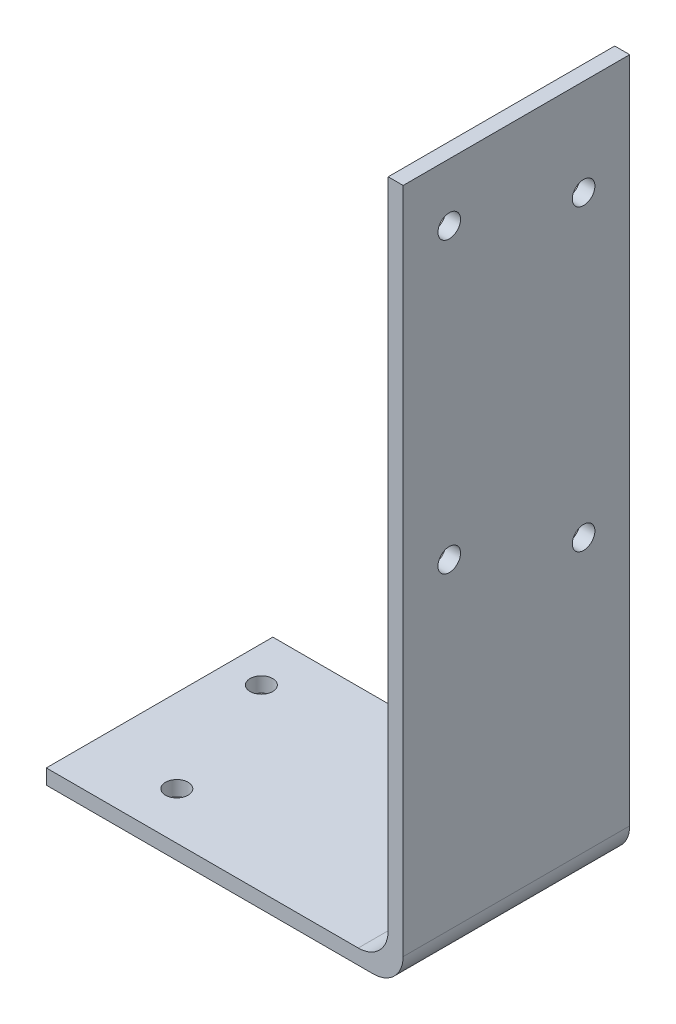
ISO-10303-21;
HEADER;
FILE_DESCRIPTION(('STEP AP214'),'2;1');
FILE_NAME('part.step','',(''),(''),'','','');
FILE_SCHEMA(('AUTOMOTIVE_DESIGN { 1 0 10303 214 1 1 1 1 }'));
ENDSEC;
DATA;
#1=APPLICATION_CONTEXT('core data for automotive mechanical design processes');
#2=APPLICATION_PROTOCOL_DEFINITION('international standard','automotive_design',2000,#1);
#3=PRODUCT_CONTEXT('',#1,'mechanical');
#4=PRODUCT('Part','Part','',(#3));
#5=PRODUCT_RELATED_PRODUCT_CATEGORY('part','',(#4));
#6=PRODUCT_DEFINITION_FORMATION('','',#4);
#7=PRODUCT_DEFINITION_CONTEXT('part definition',#1,'design');
#8=PRODUCT_DEFINITION('design','',#6,#7);
#9=PRODUCT_DEFINITION_SHAPE('','',#8);
#10=(LENGTH_UNIT() NAMED_UNIT(*) SI_UNIT(.MILLI.,.METRE.));
#11=(NAMED_UNIT(*) PLANE_ANGLE_UNIT() SI_UNIT($,.RADIAN.));
#12=(NAMED_UNIT(*) SI_UNIT($,.STERADIAN.) SOLID_ANGLE_UNIT());
#13=UNCERTAINTY_MEASURE_WITH_UNIT(LENGTH_MEASURE(1.E-05),#10,'distance_accuracy_value','');
#14=(GEOMETRIC_REPRESENTATION_CONTEXT(3) GLOBAL_UNCERTAINTY_ASSIGNED_CONTEXT((#13)) GLOBAL_UNIT_ASSIGNED_CONTEXT((#10,
#11,#12)) REPRESENTATION_CONTEXT('',''));
#15=CARTESIAN_POINT('',(0.,0.,0.));
#16=DIRECTION('',(0.,0.,1.));
#17=DIRECTION('',(1.,0.,0.));
#18=AXIS2_PLACEMENT_3D('',#15,#16,#17);
#19=CARTESIAN_POINT('',(0.,0.,38.4429));
#20=DIRECTION('',(0.,1.,0.));
#21=DIRECTION('',(0.,0.,1.));
#22=AXIS2_PLACEMENT_3D('',#19,#20,#21);
#23=PLANE('',#22);
#24=CARTESIAN_POINT('',(59.0042,0.,8.0137));
#25=DIRECTION('',(0.,1.,0.));
#26=DIRECTION('',(-1.,0.,0.));
#27=AXIS2_PLACEMENT_3D('',#24,#25,#26);
#28=CIRCLE('',#27,1.91769999999999);
#29=CARTESIAN_POINT('',(57.0865,0.,8.0137));
#30=VERTEX_POINT('',#29);
#31=EDGE_CURVE('E200',#30,#30,#28,.T.);
#32=ORIENTED_EDGE('',*,*,#31,.T.);
#33=EDGE_LOOP('',(#32));
#34=FACE_BOUND('',#33,.T.);
#35=CARTESIAN_POINT('',(67.0687,0.,30.4292));
#36=DIRECTION('',(0.,1.,0.));
#37=DIRECTION('',(-1.,0.,0.));
#38=AXIS2_PLACEMENT_3D('',#35,#36,#37);
#39=CIRCLE('',#38,1.91769999999999);
#40=CARTESIAN_POINT('',(65.151,0.,30.4292));
#41=VERTEX_POINT('',#40);
#42=EDGE_CURVE('E132',#41,#41,#39,.T.);
#43=ORIENTED_EDGE('',*,*,#42,.T.);
#44=EDGE_LOOP('',(#43));
#45=FACE_BOUND('',#44,.T.);
#46=DIRECTION('',(1.,0.,0.));
#47=VECTOR('',#46,1.);
#48=CARTESIAN_POINT('',(0.,0.,38.4429));
#49=LINE('',#48,#47);
#50=CARTESIAN_POINT('',(52.9336,0.,38.4429));
#51=VERTEX_POINT('',#50);
#52=CARTESIAN_POINT('',(108.4072,0.,38.4429));
#53=VERTEX_POINT('',#52);
#54=EDGE_CURVE('E56',#51,#53,#49,.T.);
#55=ORIENTED_EDGE('',*,*,#54,.F.);
#56=DIRECTION('',(0.,0.,-1.));
#57=VECTOR('',#56,1.);
#58=CARTESIAN_POINT('',(52.9336,0.,0.));
#59=LINE('',#58,#57);
#60=CARTESIAN_POINT('',(52.9336,0.,0.));
#61=VERTEX_POINT('',#60);
#62=EDGE_CURVE('E96',#51,#61,#59,.T.);
#63=ORIENTED_EDGE('',*,*,#62,.T.);
#64=DIRECTION('',(1.,0.,0.));
#65=VECTOR('',#64,1.);
#66=CARTESIAN_POINT('',(0.,0.,0.));
#67=LINE('',#66,#65);
#68=CARTESIAN_POINT('',(108.4072,0.,0.));
#69=VERTEX_POINT('',#68);
#70=EDGE_CURVE('E129',#61,#69,#67,.T.);
#71=ORIENTED_EDGE('',*,*,#70,.T.);
#72=DIRECTION('',(0.,0.,-1.));
#73=VECTOR('',#72,1.);
#74=CARTESIAN_POINT('',(108.4072,0.,38.4429));
#75=LINE('',#74,#73);
#76=EDGE_CURVE('E109',#69,#53,#75,.F.);
#77=ORIENTED_EDGE('',*,*,#76,.T.);
#78=EDGE_LOOP('',(#55,#63,#71,#77));
#79=FACE_BOUND('',#78,.T.);
#80=ADVANCED_FACE('F33',(#34,#45,#79),#23,.F.);
#81=CARTESIAN_POINT('',(113.4872,0.,38.4429));
#82=DIRECTION('',(-1.,0.,0.));
#83=DIRECTION('',(0.,0.,1.));
#84=AXIS2_PLACEMENT_3D('',#81,#82,#83);
#85=PLANE('',#84);
#86=CARTESIAN_POINT('',(113.4872,108.5723,30.6197));
#87=DIRECTION('',(-1.,0.,0.));
#88=DIRECTION('',(0.,-1.,0.));
#89=AXIS2_PLACEMENT_3D('',#86,#87,#88);
#90=CIRCLE('',#89,1.9177);
#91=CARTESIAN_POINT('',(113.4872,106.6546,30.6197));
#92=VERTEX_POINT('',#91);
#93=EDGE_CURVE('E176',#92,#92,#90,.T.);
#94=ORIENTED_EDGE('',*,*,#93,.T.);
#95=EDGE_LOOP('',(#94));
#96=FACE_BOUND('',#95,.T.);
#97=CARTESIAN_POINT('',(113.4872,102.0699,7.8232));
#98=DIRECTION('',(-1.,0.,0.));
#99=DIRECTION('',(0.,-1.,0.));
#100=AXIS2_PLACEMENT_3D('',#97,#98,#99);
#101=CIRCLE('',#100,1.9177);
#102=CARTESIAN_POINT('',(113.4872,100.1522,7.8232));
#103=VERTEX_POINT('',#102);
#104=EDGE_CURVE('E182',#103,#103,#101,.T.);
#105=ORIENTED_EDGE('',*,*,#104,.T.);
#106=EDGE_LOOP('',(#105));
#107=FACE_BOUND('',#106,.T.);
#108=CARTESIAN_POINT('',(113.4872,59.5249,30.6197));
#109=DIRECTION('',(-1.,0.,0.));
#110=DIRECTION('',(0.,-1.,0.));
#111=AXIS2_PLACEMENT_3D('',#108,#109,#110);
#112=CIRCLE('',#111,1.9177);
#113=CARTESIAN_POINT('',(113.4872,57.6072,30.6197));
#114=VERTEX_POINT('',#113);
#115=EDGE_CURVE('E188',#114,#114,#112,.T.);
#116=ORIENTED_EDGE('',*,*,#115,.T.);
#117=EDGE_LOOP('',(#116));
#118=FACE_BOUND('',#117,.T.);
#119=CARTESIAN_POINT('',(113.4872,51.3842,7.8232));
#120=DIRECTION('',(-1.,0.,0.));
#121=DIRECTION('',(0.,-1.,0.));
#122=AXIS2_PLACEMENT_3D('',#119,#120,#121);
#123=CIRCLE('',#122,1.9177);
#124=CARTESIAN_POINT('',(113.4872,49.4665,7.8232));
#125=VERTEX_POINT('',#124);
#126=EDGE_CURVE('E194',#125,#125,#123,.T.);
#127=ORIENTED_EDGE('',*,*,#126,.T.);
#128=EDGE_LOOP('',(#127));
#129=FACE_BOUND('',#128,.T.);
#130=DIRECTION('',(0.,1.,0.));
#131=VECTOR('',#130,1.);
#132=CARTESIAN_POINT('',(113.4872,0.,38.4429));
#133=LINE('',#132,#131);
#134=CARTESIAN_POINT('',(113.4872,5.08,38.4429));
#135=VERTEX_POINT('',#134);
#136=CARTESIAN_POINT('',(113.4872,118.4148,38.4429));
#137=VERTEX_POINT('',#136);
#138=EDGE_CURVE('E111',#135,#137,#133,.T.);
#139=ORIENTED_EDGE('',*,*,#138,.F.);
#140=DIRECTION('',(0.,0.,-1.));
#141=VECTOR('',#140,1.);
#142=CARTESIAN_POINT('',(113.4872,5.08,38.4429));
#143=LINE('',#142,#141);
#144=CARTESIAN_POINT('',(113.4872,5.08,0.));
#145=VERTEX_POINT('',#144);
#146=EDGE_CURVE('E148',#135,#145,#143,.T.);
#147=ORIENTED_EDGE('',*,*,#146,.T.);
#148=DIRECTION('',(0.,1.,0.));
#149=VECTOR('',#148,1.);
#150=CARTESIAN_POINT('',(113.4872,0.,0.));
#151=LINE('',#150,#149);
#152=CARTESIAN_POINT('',(113.4872,118.4148,0.));
#153=VERTEX_POINT('',#152);
#154=EDGE_CURVE('E131',#145,#153,#151,.T.);
#155=ORIENTED_EDGE('',*,*,#154,.T.);
#156=DIRECTION('',(0.,0.,-1.));
#157=VECTOR('',#156,1.);
#158=CARTESIAN_POINT('',(113.4872,118.4148,38.4429));
#159=LINE('',#158,#157);
#160=EDGE_CURVE('E140',#137,#153,#159,.T.);
#161=ORIENTED_EDGE('',*,*,#160,.F.);
#162=EDGE_LOOP('',(#139,#147,#155,#161));
#163=FACE_BOUND('',#162,.T.);
#164=ADVANCED_FACE('F226',(#96,#107,#118,#129,#163),#85,.F.);
#165=CARTESIAN_POINT('',(113.4872,118.4148,38.4429));
#166=DIRECTION('',(0.,-1.,0.));
#167=DIRECTION('',(0.,0.,-1.));
#168=AXIS2_PLACEMENT_3D('',#165,#166,#167);
#169=PLANE('',#168);
#170=DIRECTION('',(-1.,0.,0.));
#171=VECTOR('',#170,1.);
#172=CARTESIAN_POINT('',(113.4872,118.4148,0.));
#173=LINE('',#172,#171);
#174=CARTESIAN_POINT('',(110.9472,118.4148,0.));
#175=VERTEX_POINT('',#174);
#176=EDGE_CURVE('E134',#153,#175,#173,.T.);
#177=ORIENTED_EDGE('',*,*,#176,.T.);
#178=DIRECTION('',(0.,0.,-1.));
#179=VECTOR('',#178,1.);
#180=CARTESIAN_POINT('',(110.9472,118.4148,38.4429));
#181=LINE('',#180,#179);
#182=CARTESIAN_POINT('',(110.9472,118.4148,38.4429));
#183=VERTEX_POINT('',#182);
#184=EDGE_CURVE('E128',#183,#175,#181,.T.);
#185=ORIENTED_EDGE('',*,*,#184,.F.);
#186=DIRECTION('',(-1.,0.,0.));
#187=VECTOR('',#186,1.);
#188=CARTESIAN_POINT('',(113.4872,118.4148,38.4429));
#189=LINE('',#188,#187);
#190=EDGE_CURVE('E114',#137,#183,#189,.T.);
#191=ORIENTED_EDGE('',*,*,#190,.F.);
#192=ORIENTED_EDGE('',*,*,#160,.T.);
#193=EDGE_LOOP('',(#177,#185,#191,#192));
#194=FACE_BOUND('',#193,.T.);
#195=ADVANCED_FACE('F220',(#194),#169,.F.);
#196=CARTESIAN_POINT('',(110.9472,118.4148,38.4429));
#197=DIRECTION('',(1.,0.,0.));
#198=DIRECTION('',(0.,1.,0.));
#199=AXIS2_PLACEMENT_3D('',#196,#197,#198);
#200=PLANE('',#199);
#201=CARTESIAN_POINT('',(110.9472,108.5723,30.6197));
#202=DIRECTION('',(-1.,0.,0.));
#203=DIRECTION('',(0.,-1.,0.));
#204=AXIS2_PLACEMENT_3D('',#201,#202,#203);
#205=CIRCLE('',#204,1.9177);
#206=CARTESIAN_POINT('',(110.9472,106.6546,30.6197));
#207=VERTEX_POINT('',#206);
#208=EDGE_CURVE('E174',#207,#207,#205,.T.);
#209=ORIENTED_EDGE('',*,*,#208,.F.);
#210=EDGE_LOOP('',(#209));
#211=FACE_BOUND('',#210,.T.);
#212=CARTESIAN_POINT('',(110.9472,102.0699,7.8232));
#213=DIRECTION('',(-1.,0.,0.));
#214=DIRECTION('',(0.,-1.,0.));
#215=AXIS2_PLACEMENT_3D('',#212,#213,#214);
#216=CIRCLE('',#215,1.9177);
#217=CARTESIAN_POINT('',(110.9472,100.1522,7.8232));
#218=VERTEX_POINT('',#217);
#219=EDGE_CURVE('E179',#218,#218,#216,.T.);
#220=ORIENTED_EDGE('',*,*,#219,.F.);
#221=EDGE_LOOP('',(#220));
#222=FACE_BOUND('',#221,.T.);
#223=CARTESIAN_POINT('',(110.9472,59.5249,30.6197));
#224=DIRECTION('',(-1.,0.,0.));
#225=DIRECTION('',(0.,-1.,0.));
#226=AXIS2_PLACEMENT_3D('',#223,#224,#225);
#227=CIRCLE('',#226,1.9177);
#228=CARTESIAN_POINT('',(110.9472,57.6072,30.6197));
#229=VERTEX_POINT('',#228);
#230=EDGE_CURVE('E185',#229,#229,#227,.T.);
#231=ORIENTED_EDGE('',*,*,#230,.F.);
#232=EDGE_LOOP('',(#231));
#233=FACE_BOUND('',#232,.T.);
#234=CARTESIAN_POINT('',(110.9472,51.3842,7.8232));
#235=DIRECTION('',(-1.,0.,0.));
#236=DIRECTION('',(0.,-1.,0.));
#237=AXIS2_PLACEMENT_3D('',#234,#235,#236);
#238=CIRCLE('',#237,1.9177);
#239=CARTESIAN_POINT('',(110.9472,49.4665,7.8232));
#240=VERTEX_POINT('',#239);
#241=EDGE_CURVE('E191',#240,#240,#238,.T.);
#242=ORIENTED_EDGE('',*,*,#241,.F.);
#243=EDGE_LOOP('',(#242));
#244=FACE_BOUND('',#243,.T.);
#245=DIRECTION('',(0.,-1.,0.));
#246=VECTOR('',#245,1.);
#247=CARTESIAN_POINT('',(110.9472,118.4148,0.));
#248=LINE('',#247,#246);
#249=CARTESIAN_POINT('',(110.9472,7.62000000000002,0.));
#250=VERTEX_POINT('',#249);
#251=EDGE_CURVE('E117',#175,#250,#248,.T.);
#252=ORIENTED_EDGE('',*,*,#251,.T.);
#253=DIRECTION('',(0.,0.,-1.));
#254=VECTOR('',#253,1.);
#255=CARTESIAN_POINT('',(110.9472,7.62000000000001,38.4429));
#256=LINE('',#255,#254);
#257=CARTESIAN_POINT('',(110.9472,7.62000000000002,38.4429));
#258=VERTEX_POINT('',#257);
#259=EDGE_CURVE('E146',#250,#258,#256,.F.);
#260=ORIENTED_EDGE('',*,*,#259,.T.);
#261=DIRECTION('',(0.,-1.,0.));
#262=VECTOR('',#261,1.);
#263=CARTESIAN_POINT('',(110.9472,118.4148,38.4429));
#264=LINE('',#263,#262);
#265=EDGE_CURVE('E124',#183,#258,#264,.T.);
#266=ORIENTED_EDGE('',*,*,#265,.F.);
#267=ORIENTED_EDGE('',*,*,#184,.T.);
#268=EDGE_LOOP('',(#252,#260,#266,#267));
#269=FACE_BOUND('',#268,.T.);
#270=ADVANCED_FACE('F165',(#211,#222,#233,#244,#269),#200,.F.);
#271=CARTESIAN_POINT('',(110.9472,2.54000000000001,38.4429));
#272=DIRECTION('',(0.,-1.,0.));
#273=DIRECTION('',(1.,0.,0.));
#274=AXIS2_PLACEMENT_3D('',#271,#272,#273);
#275=PLANE('',#274);
#276=CARTESIAN_POINT('',(59.0042,2.54000000000001,8.0137));
#277=DIRECTION('',(0.,1.,0.));
#278=DIRECTION('',(-1.,0.,0.));
#279=AXIS2_PLACEMENT_3D('',#276,#277,#278);
#280=CIRCLE('',#279,1.91769999999999);
#281=CARTESIAN_POINT('',(57.0865,2.54000000000001,8.0137));
#282=VERTEX_POINT('',#281);
#283=EDGE_CURVE('E197',#282,#282,#280,.T.);
#284=ORIENTED_EDGE('',*,*,#283,.F.);
#285=EDGE_LOOP('',(#284));
#286=FACE_BOUND('',#285,.T.);
#287=CARTESIAN_POINT('',(67.0687,2.54000000000001,30.4292));
#288=DIRECTION('',(0.,1.,0.));
#289=DIRECTION('',(-1.,0.,0.));
#290=AXIS2_PLACEMENT_3D('',#287,#288,#289);
#291=CIRCLE('',#290,1.91769999999999);
#292=CARTESIAN_POINT('',(65.151,2.54000000000001,30.4292));
#293=VERTEX_POINT('',#292);
#294=EDGE_CURVE('E120',#293,#293,#291,.T.);
#295=ORIENTED_EDGE('',*,*,#294,.F.);
#296=EDGE_LOOP('',(#295));
#297=FACE_BOUND('',#296,.T.);
#298=DIRECTION('',(-1.,0.,0.));
#299=VECTOR('',#298,1.);
#300=CARTESIAN_POINT('',(110.9472,2.54000000000001,0.));
#301=LINE('',#300,#299);
#302=CARTESIAN_POINT('',(105.8672,2.54000000000001,0.));
#303=VERTEX_POINT('',#302);
#304=CARTESIAN_POINT('',(52.9336,2.54000000000001,0.));
#305=VERTEX_POINT('',#304);
#306=EDGE_CURVE('E112',#303,#305,#301,.T.);
#307=ORIENTED_EDGE('',*,*,#306,.T.);
#308=DIRECTION('',(0.,0.,-1.));
#309=VECTOR('',#308,1.);
#310=CARTESIAN_POINT('',(52.9336,2.54000000000001,0.));
#311=LINE('',#310,#309);
#312=CARTESIAN_POINT('',(52.9336,2.54000000000001,38.4429));
#313=VERTEX_POINT('',#312);
#314=EDGE_CURVE('E48',#313,#305,#311,.T.);
#315=ORIENTED_EDGE('',*,*,#314,.F.);
#316=DIRECTION('',(-1.,0.,0.));
#317=VECTOR('',#316,1.);
#318=CARTESIAN_POINT('',(110.9472,2.54000000000001,38.4429));
#319=LINE('',#318,#317);
#320=CARTESIAN_POINT('',(105.8672,2.54000000000001,38.4429));
#321=VERTEX_POINT('',#320);
#322=EDGE_CURVE('E106',#321,#313,#319,.T.);
#323=ORIENTED_EDGE('',*,*,#322,.F.);
#324=DIRECTION('',(0.,0.,-1.));
#325=VECTOR('',#324,1.);
#326=CARTESIAN_POINT('',(105.8672,2.54000000000001,0.));
#327=LINE('',#326,#325);
#328=EDGE_CURVE('E143',#321,#303,#327,.T.);
#329=ORIENTED_EDGE('',*,*,#328,.T.);
#330=EDGE_LOOP('',(#307,#315,#323,#329));
#331=FACE_BOUND('',#330,.T.);
#332=ADVANCED_FACE('F171',(#286,#297,#331),#275,.F.);
#333=CARTESIAN_POINT('',(0.,0.,38.4429));
#334=DIRECTION('',(0.,0.,1.));
#335=DIRECTION('',(1.,0.,0.));
#336=AXIS2_PLACEMENT_3D('',#333,#334,#335);
#337=PLANE('',#336);
#338=DIRECTION('',(0.,1.,0.));
#339=VECTOR('',#338,1.);
#340=CARTESIAN_POINT('',(52.9336,0.,38.4429));
#341=LINE('',#340,#339);
#342=EDGE_CURVE('E98',#51,#313,#341,.T.);
#343=ORIENTED_EDGE('',*,*,#342,.F.);
#344=ORIENTED_EDGE('',*,*,#54,.T.);
#345=CARTESIAN_POINT('',(108.4072,5.08,38.4429));
#346=DIRECTION('',(0.,0.,1.));
#347=DIRECTION('',(1.,0.,0.));
#348=AXIS2_PLACEMENT_3D('',#345,#346,#347);
#349=CIRCLE('',#348,5.08);
#350=EDGE_CURVE('E155',#53,#135,#349,.T.);
#351=ORIENTED_EDGE('',*,*,#350,.T.);
#352=ORIENTED_EDGE('',*,*,#138,.T.);
#353=ORIENTED_EDGE('',*,*,#190,.T.);
#354=ORIENTED_EDGE('',*,*,#265,.T.);
#355=CARTESIAN_POINT('',(105.8672,7.62000000000001,38.4429));
#356=DIRECTION('',(0.,0.,1.));
#357=DIRECTION('',(1.,0.,0.));
#358=AXIS2_PLACEMENT_3D('',#355,#356,#357);
#359=CIRCLE('',#358,5.08);
#360=EDGE_CURVE('E11',#258,#321,#359,.F.);
#361=ORIENTED_EDGE('',*,*,#360,.T.);
#362=ORIENTED_EDGE('',*,*,#322,.T.);
#363=EDGE_LOOP('',(#343,#344,#351,#352,#353,#354,#361,#362));
#364=FACE_BOUND('',#363,.T.);
#365=ADVANCED_FACE('F104',(#364),#337,.T.);
#366=CARTESIAN_POINT('',(0.,0.,0.));
#367=DIRECTION('',(0.,0.,1.));
#368=DIRECTION('',(1.,0.,0.));
#369=AXIS2_PLACEMENT_3D('',#366,#367,#368);
#370=PLANE('',#369);
#371=ORIENTED_EDGE('',*,*,#70,.F.);
#372=DIRECTION('',(0.,1.,0.));
#373=VECTOR('',#372,1.);
#374=CARTESIAN_POINT('',(52.9336,0.,0.));
#375=LINE('',#374,#373);
#376=EDGE_CURVE('E99',#61,#305,#375,.T.);
#377=ORIENTED_EDGE('',*,*,#376,.T.);
#378=ORIENTED_EDGE('',*,*,#306,.F.);
#379=CARTESIAN_POINT('',(105.8672,7.62000000000001,0.));
#380=DIRECTION('',(0.,0.,1.));
#381=DIRECTION('',(1.,0.,0.));
#382=AXIS2_PLACEMENT_3D('',#379,#380,#381);
#383=CIRCLE('',#382,5.08);
#384=EDGE_CURVE('E41',#303,#250,#383,.T.);
#385=ORIENTED_EDGE('',*,*,#384,.T.);
#386=ORIENTED_EDGE('',*,*,#251,.F.);
#387=ORIENTED_EDGE('',*,*,#176,.F.);
#388=ORIENTED_EDGE('',*,*,#154,.F.);
#389=CARTESIAN_POINT('',(108.4072,5.08,0.));
#390=DIRECTION('',(0.,0.,1.));
#391=DIRECTION('',(1.,0.,0.));
#392=AXIS2_PLACEMENT_3D('',#389,#390,#391);
#393=CIRCLE('',#392,5.08);
#394=EDGE_CURVE('E151',#145,#69,#393,.F.);
#395=ORIENTED_EDGE('',*,*,#394,.T.);
#396=EDGE_LOOP('',(#371,#377,#378,#385,#386,#387,#388,#395));
#397=FACE_BOUND('',#396,.T.);
#398=ADVANCED_FACE('F159',(#397),#370,.F.);
#399=CARTESIAN_POINT('',(67.0687,0.,30.4292));
#400=DIRECTION('',(0.,1.,0.));
#401=DIRECTION('',(-1.,0.,0.));
#402=AXIS2_PLACEMENT_3D('',#399,#400,#401);
#403=CYLINDRICAL_SURFACE('',#402,1.91769999999999);
#404=ORIENTED_EDGE('',*,*,#42,.F.);
#405=EDGE_LOOP('',(#404));
#406=FACE_BOUND('',#405,.T.);
#407=ORIENTED_EDGE('',*,*,#294,.T.);
#408=EDGE_LOOP('',(#407));
#409=FACE_BOUND('',#408,.T.);
#410=ADVANCED_FACE('F210',(#406,#409),#403,.F.);
#411=CARTESIAN_POINT('',(59.0042,0.,8.0137));
#412=DIRECTION('',(0.,1.,0.));
#413=DIRECTION('',(-1.,0.,0.));
#414=AXIS2_PLACEMENT_3D('',#411,#412,#413);
#415=CYLINDRICAL_SURFACE('',#414,1.91769999999999);
#416=ORIENTED_EDGE('',*,*,#31,.F.);
#417=EDGE_LOOP('',(#416));
#418=FACE_BOUND('',#417,.T.);
#419=ORIENTED_EDGE('',*,*,#283,.T.);
#420=EDGE_LOOP('',(#419));
#421=FACE_BOUND('',#420,.T.);
#422=ADVANCED_FACE('F261',(#418,#421),#415,.F.);
#423=CARTESIAN_POINT('',(113.4872,51.3842,7.8232));
#424=DIRECTION('',(-1.,0.,0.));
#425=DIRECTION('',(0.,-1.,0.));
#426=AXIS2_PLACEMENT_3D('',#423,#424,#425);
#427=CYLINDRICAL_SURFACE('',#426,1.9177);
#428=ORIENTED_EDGE('',*,*,#126,.F.);
#429=EDGE_LOOP('',(#428));
#430=FACE_BOUND('',#429,.T.);
#431=ORIENTED_EDGE('',*,*,#241,.T.);
#432=EDGE_LOOP('',(#431));
#433=FACE_BOUND('',#432,.T.);
#434=ADVANCED_FACE('F257',(#430,#433),#427,.F.);
#435=CARTESIAN_POINT('',(113.4872,59.5249,30.6197));
#436=DIRECTION('',(-1.,0.,0.));
#437=DIRECTION('',(0.,-1.,0.));
#438=AXIS2_PLACEMENT_3D('',#435,#436,#437);
#439=CYLINDRICAL_SURFACE('',#438,1.9177);
#440=ORIENTED_EDGE('',*,*,#115,.F.);
#441=EDGE_LOOP('',(#440));
#442=FACE_BOUND('',#441,.T.);
#443=ORIENTED_EDGE('',*,*,#230,.T.);
#444=EDGE_LOOP('',(#443));
#445=FACE_BOUND('',#444,.T.);
#446=ADVANCED_FACE('F248',(#442,#445),#439,.F.);
#447=CARTESIAN_POINT('',(113.4872,102.0699,7.8232));
#448=DIRECTION('',(-1.,0.,0.));
#449=DIRECTION('',(0.,-1.,0.));
#450=AXIS2_PLACEMENT_3D('',#447,#448,#449);
#451=CYLINDRICAL_SURFACE('',#450,1.9177);
#452=ORIENTED_EDGE('',*,*,#104,.F.);
#453=EDGE_LOOP('',(#452));
#454=FACE_BOUND('',#453,.T.);
#455=ORIENTED_EDGE('',*,*,#219,.T.);
#456=EDGE_LOOP('',(#455));
#457=FACE_BOUND('',#456,.T.);
#458=ADVANCED_FACE('F242',(#454,#457),#451,.F.);
#459=CARTESIAN_POINT('',(113.4872,108.5723,30.6197));
#460=DIRECTION('',(-1.,0.,0.));
#461=DIRECTION('',(0.,-1.,0.));
#462=AXIS2_PLACEMENT_3D('',#459,#460,#461);
#463=CYLINDRICAL_SURFACE('',#462,1.9177);
#464=ORIENTED_EDGE('',*,*,#93,.F.);
#465=EDGE_LOOP('',(#464));
#466=FACE_BOUND('',#465,.T.);
#467=ORIENTED_EDGE('',*,*,#208,.T.);
#468=EDGE_LOOP('',(#467));
#469=FACE_BOUND('',#468,.T.);
#470=ADVANCED_FACE('F236',(#466,#469),#463,.F.);
#471=CARTESIAN_POINT('',(105.8672,7.62000000000001,38.4429));
#472=DIRECTION('',(0.,0.,1.));
#473=DIRECTION('',(1.,0.,0.));
#474=AXIS2_PLACEMENT_3D('',#471,#472,#473);
#475=CYLINDRICAL_SURFACE('',#474,5.08);
#476=ORIENTED_EDGE('',*,*,#360,.F.);
#477=ORIENTED_EDGE('',*,*,#259,.F.);
#478=ORIENTED_EDGE('',*,*,#384,.F.);
#479=ORIENTED_EDGE('',*,*,#328,.F.);
#480=EDGE_LOOP('',(#476,#477,#478,#479));
#481=FACE_BOUND('',#480,.T.);
#482=ADVANCED_FACE('F169',(#481),#475,.F.);
#483=CARTESIAN_POINT('',(108.4072,5.08,38.4429));
#484=DIRECTION('',(0.,0.,-1.));
#485=DIRECTION('',(-1.,0.,0.));
#486=AXIS2_PLACEMENT_3D('',#483,#484,#485);
#487=CYLINDRICAL_SURFACE('',#486,5.08);
#488=ORIENTED_EDGE('',*,*,#350,.F.);
#489=ORIENTED_EDGE('',*,*,#76,.F.);
#490=ORIENTED_EDGE('',*,*,#394,.F.);
#491=ORIENTED_EDGE('',*,*,#146,.F.);
#492=EDGE_LOOP('',(#488,#489,#490,#491));
#493=FACE_BOUND('',#492,.T.);
#494=ADVANCED_FACE('F35',(#493),#487,.T.);
#495=CARTESIAN_POINT('',(52.9336,0.,0.));
#496=DIRECTION('',(1.,0.,0.));
#497=DIRECTION('',(0.,0.,-1.));
#498=AXIS2_PLACEMENT_3D('',#495,#496,#497);
#499=PLANE('',#498);
#500=ORIENTED_EDGE('',*,*,#314,.T.);
#501=ORIENTED_EDGE('',*,*,#376,.F.);
#502=ORIENTED_EDGE('',*,*,#62,.F.);
#503=ORIENTED_EDGE('',*,*,#342,.T.);
#504=EDGE_LOOP('',(#500,#501,#502,#503));
#505=FACE_BOUND('',#504,.T.);
#506=ADVANCED_FACE('F97',(#505),#499,.F.);
#507=CLOSED_SHELL('',(#80,#164,#195,#270,#332,#365,#398,#410,#422,#434,#446,#458,#470,#482,#494,#506));
#508=MANIFOLD_SOLID_BREP('B2',#507);
#509=ADVANCED_BREP_SHAPE_REPRESENTATION('',(#18,#508),#14);
#510=SHAPE_DEFINITION_REPRESENTATION(#9,#509);
ENDSEC;
END-ISO-10303-21;
